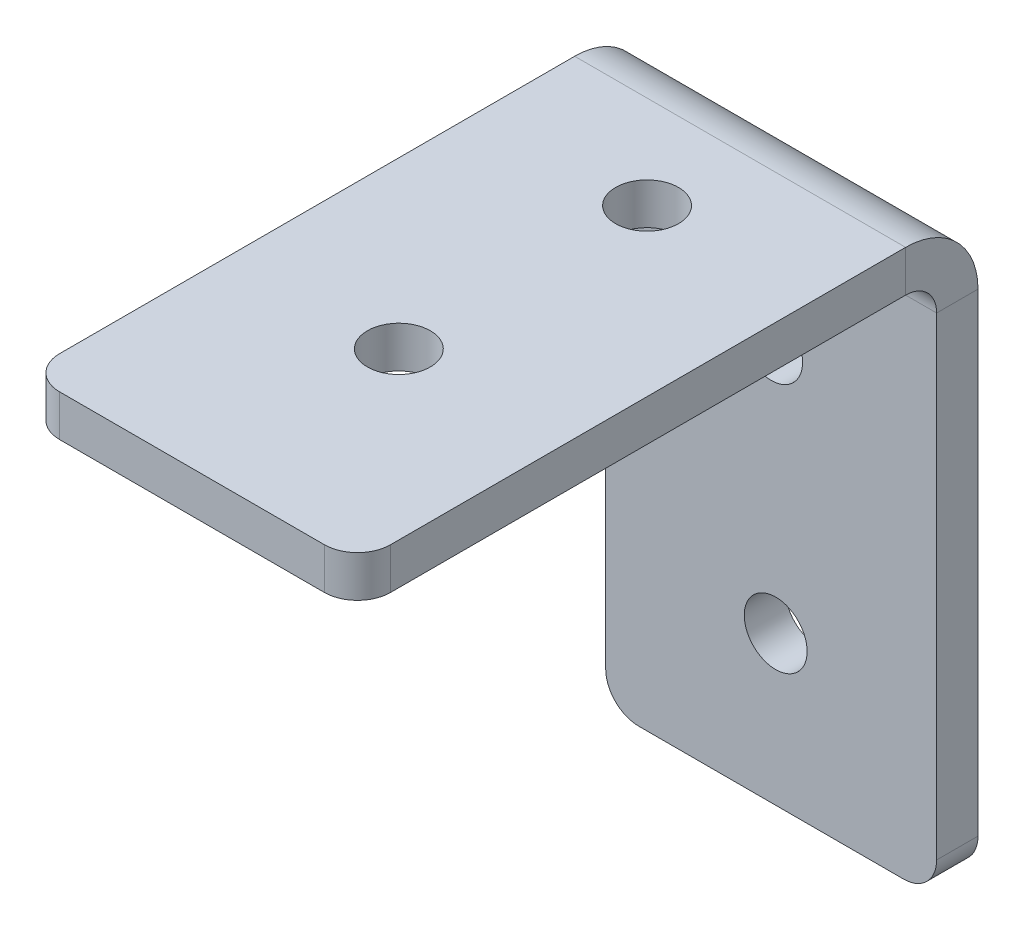
ISO-10303-21;
HEADER;
FILE_DESCRIPTION(('STEP AP214'),'2;1');
FILE_NAME('part.step','',(''),(''),'','','');
FILE_SCHEMA(('AUTOMOTIVE_DESIGN { 1 0 10303 214 1 1 1 1 }'));
ENDSEC;
DATA;
#1=APPLICATION_CONTEXT('core data for automotive mechanical design processes');
#2=APPLICATION_PROTOCOL_DEFINITION('international standard','automotive_design',2000,#1);
#3=PRODUCT_CONTEXT('',#1,'mechanical');
#4=PRODUCT('Part','Part','',(#3));
#5=PRODUCT_RELATED_PRODUCT_CATEGORY('part','',(#4));
#6=PRODUCT_DEFINITION_FORMATION('','',#4);
#7=PRODUCT_DEFINITION_CONTEXT('part definition',#1,'design');
#8=PRODUCT_DEFINITION('design','',#6,#7);
#9=PRODUCT_DEFINITION_SHAPE('','',#8);
#10=(LENGTH_UNIT() NAMED_UNIT(*) SI_UNIT(.MILLI.,.METRE.));
#11=(NAMED_UNIT(*) PLANE_ANGLE_UNIT() SI_UNIT($,.RADIAN.));
#12=(NAMED_UNIT(*) SI_UNIT($,.STERADIAN.) SOLID_ANGLE_UNIT());
#13=UNCERTAINTY_MEASURE_WITH_UNIT(LENGTH_MEASURE(1.E-05),#10,'distance_accuracy_value','');
#14=(GEOMETRIC_REPRESENTATION_CONTEXT(3) GLOBAL_UNCERTAINTY_ASSIGNED_CONTEXT((#13)) GLOBAL_UNIT_ASSIGNED_CONTEXT((#10,
#11,#12)) REPRESENTATION_CONTEXT('',''));
#15=CARTESIAN_POINT('',(0.,0.,0.));
#16=DIRECTION('',(0.,0.,1.));
#17=DIRECTION('',(1.,0.,0.));
#18=AXIS2_PLACEMENT_3D('',#15,#16,#17);
#19=CARTESIAN_POINT('',(12.7,19.05,47.625));
#20=DIRECTION('',(1.,0.,0.));
#21=DIRECTION('',(0.,0.,-1.));
#22=AXIS2_PLACEMENT_3D('',#19,#20,#21);
#23=PLANE('',#22);
#24=DIRECTION('',(0.,-1.,0.));
#25=VECTOR('',#24,1.);
#26=CARTESIAN_POINT('',(12.7,19.05,5.555000066));
#27=LINE('',#26,#25);
#28=CARTESIAN_POINT('',(12.7,22.225,5.555000066));
#29=VERTEX_POINT('',#28);
#30=CARTESIAN_POINT('',(12.7,19.05,5.555000066));
#31=VERTEX_POINT('',#30);
#32=EDGE_CURVE('E11',#29,#31,#27,.T.);
#33=ORIENTED_EDGE('',*,*,#32,.F.);
#34=DIRECTION('',(0.,0.,1.));
#35=VECTOR('',#34,1.);
#36=CARTESIAN_POINT('',(12.7,22.225,47.625));
#37=LINE('',#36,#35);
#38=CARTESIAN_POINT('',(12.7,22.225,45.085));
#39=VERTEX_POINT('',#38);
#40=EDGE_CURVE('E102',#39,#29,#37,.F.);
#41=ORIENTED_EDGE('',*,*,#40,.F.);
#42=DIRECTION('',(0.,-1.,0.));
#43=VECTOR('',#42,1.);
#44=CARTESIAN_POINT('',(12.7,19.05,45.085));
#45=LINE('',#44,#43);
#46=CARTESIAN_POINT('',(12.7,19.05,45.085));
#47=VERTEX_POINT('',#46);
#48=EDGE_CURVE('E50',#39,#47,#45,.T.);
#49=ORIENTED_EDGE('',*,*,#48,.T.);
#50=DIRECTION('',(0.,0.,-1.));
#51=VECTOR('',#50,1.);
#52=CARTESIAN_POINT('',(12.7,19.05,47.625));
#53=LINE('',#52,#51);
#54=EDGE_CURVE('E105',#47,#31,#53,.T.);
#55=ORIENTED_EDGE('',*,*,#54,.T.);
#56=EDGE_LOOP('',(#33,#41,#49,#55));
#57=FACE_BOUND('',#56,.T.);
#58=ADVANCED_FACE('F40',(#57),#23,.T.);
#59=CARTESIAN_POINT('',(10.16,19.05,45.085));
#60=DIRECTION('',(0.,1.,0.));
#61=DIRECTION('',(-1.,0.,0.));
#62=AXIS2_PLACEMENT_3D('',#59,#60,#61);
#63=CYLINDRICAL_SURFACE('',#62,2.54);
#64=ORIENTED_EDGE('',*,*,#48,.F.);
#65=CARTESIAN_POINT('',(10.16,22.225,45.085));
#66=DIRECTION('',(0.,1.,0.));
#67=DIRECTION('',(-1.,0.,0.));
#68=AXIS2_PLACEMENT_3D('',#65,#66,#67);
#69=CIRCLE('',#68,2.54);
#70=CARTESIAN_POINT('',(10.16,22.225,47.625));
#71=VERTEX_POINT('',#70);
#72=EDGE_CURVE('E131',#39,#71,#69,.F.);
#73=ORIENTED_EDGE('',*,*,#72,.T.);
#74=DIRECTION('',(0.,-1.,0.));
#75=VECTOR('',#74,1.);
#76=CARTESIAN_POINT('',(10.16,19.05,47.625));
#77=LINE('',#76,#75);
#78=CARTESIAN_POINT('',(10.16,19.05,47.625));
#79=VERTEX_POINT('',#78);
#80=EDGE_CURVE('E168',#71,#79,#77,.T.);
#81=ORIENTED_EDGE('',*,*,#80,.T.);
#82=CARTESIAN_POINT('',(10.16,19.05,45.085));
#83=DIRECTION('',(0.,1.,0.));
#84=DIRECTION('',(-1.,0.,0.));
#85=AXIS2_PLACEMENT_3D('',#82,#83,#84);
#86=CIRCLE('',#85,2.54);
#87=EDGE_CURVE('E180',#47,#79,#86,.F.);
#88=ORIENTED_EDGE('',*,*,#87,.F.);
#89=EDGE_LOOP('',(#64,#73,#81,#88));
#90=FACE_BOUND('',#89,.T.);
#91=ADVANCED_FACE('F186',(#90),#63,.T.);
#92=CARTESIAN_POINT('',(-12.7,19.05,47.625));
#93=DIRECTION('',(0.,0.,1.));
#94=DIRECTION('',(1.,0.,0.));
#95=AXIS2_PLACEMENT_3D('',#92,#93,#94);
#96=PLANE('',#95);
#97=ORIENTED_EDGE('',*,*,#80,.F.);
#98=DIRECTION('',(-1.,0.,0.));
#99=VECTOR('',#98,1.);
#100=CARTESIAN_POINT('',(-12.7,22.225,47.625));
#101=LINE('',#100,#99);
#102=CARTESIAN_POINT('',(-10.16,22.225,47.625));
#103=VERTEX_POINT('',#102);
#104=EDGE_CURVE('E252',#103,#71,#101,.F.);
#105=ORIENTED_EDGE('',*,*,#104,.F.);
#106=DIRECTION('',(0.,-1.,0.));
#107=VECTOR('',#106,1.);
#108=CARTESIAN_POINT('',(-10.16,19.05,47.625));
#109=LINE('',#108,#107);
#110=CARTESIAN_POINT('',(-10.16,19.05,47.625));
#111=VERTEX_POINT('',#110);
#112=EDGE_CURVE('E165',#103,#111,#109,.T.);
#113=ORIENTED_EDGE('',*,*,#112,.T.);
#114=DIRECTION('',(1.,0.,0.));
#115=VECTOR('',#114,1.);
#116=CARTESIAN_POINT('',(-12.7,19.05,47.625));
#117=LINE('',#116,#115);
#118=EDGE_CURVE('E187',#111,#79,#117,.T.);
#119=ORIENTED_EDGE('',*,*,#118,.T.);
#120=EDGE_LOOP('',(#97,#105,#113,#119));
#121=FACE_BOUND('',#120,.T.);
#122=ADVANCED_FACE('F256',(#121),#96,.T.);
#123=CARTESIAN_POINT('',(-10.16,19.05,45.085));
#124=DIRECTION('',(0.,1.,0.));
#125=DIRECTION('',(-1.,0.,0.));
#126=AXIS2_PLACEMENT_3D('',#123,#124,#125);
#127=CYLINDRICAL_SURFACE('',#126,2.54);
#128=ORIENTED_EDGE('',*,*,#112,.F.);
#129=CARTESIAN_POINT('',(-10.16,22.225,45.085));
#130=DIRECTION('',(0.,1.,0.));
#131=DIRECTION('',(-1.,0.,0.));
#132=AXIS2_PLACEMENT_3D('',#129,#130,#131);
#133=CIRCLE('',#132,2.54);
#134=CARTESIAN_POINT('',(-12.7,22.225,45.085));
#135=VERTEX_POINT('',#134);
#136=EDGE_CURVE('E249',#103,#135,#133,.F.);
#137=ORIENTED_EDGE('',*,*,#136,.T.);
#138=DIRECTION('',(0.,-1.,0.));
#139=VECTOR('',#138,1.);
#140=CARTESIAN_POINT('',(-12.7,19.05,45.085));
#141=LINE('',#140,#139);
#142=CARTESIAN_POINT('',(-12.7,19.05,45.085));
#143=VERTEX_POINT('',#142);
#144=EDGE_CURVE('E162',#135,#143,#141,.T.);
#145=ORIENTED_EDGE('',*,*,#144,.T.);
#146=CARTESIAN_POINT('',(-10.16,19.05,45.085));
#147=DIRECTION('',(0.,1.,0.));
#148=DIRECTION('',(-1.,0.,0.));
#149=AXIS2_PLACEMENT_3D('',#146,#147,#148);
#150=CIRCLE('',#149,2.54);
#151=EDGE_CURVE('E189',#111,#143,#150,.F.);
#152=ORIENTED_EDGE('',*,*,#151,.F.);
#153=EDGE_LOOP('',(#128,#137,#145,#152));
#154=FACE_BOUND('',#153,.T.);
#155=ADVANCED_FACE('F264',(#154),#127,.T.);
#156=CARTESIAN_POINT('',(-12.7,19.05,47.625));
#157=DIRECTION('',(1.,0.,0.));
#158=DIRECTION('',(0.,0.,-1.));
#159=AXIS2_PLACEMENT_3D('',#156,#157,#158);
#160=PLANE('',#159);
#161=ORIENTED_EDGE('',*,*,#144,.F.);
#162=DIRECTION('',(0.,0.,1.));
#163=VECTOR('',#162,1.);
#164=CARTESIAN_POINT('',(-12.7,22.225,47.625));
#165=LINE('',#164,#163);
#166=CARTESIAN_POINT('',(-12.7,22.225,5.555000066));
#167=VERTEX_POINT('',#166);
#168=EDGE_CURVE('E232',#135,#167,#165,.F.);
#169=ORIENTED_EDGE('',*,*,#168,.T.);
#170=DIRECTION('',(0.,-1.,0.));
#171=VECTOR('',#170,1.);
#172=CARTESIAN_POINT('',(-12.7,19.05,5.555000066));
#173=LINE('',#172,#171);
#174=CARTESIAN_POINT('',(-12.7,19.05,5.555000066));
#175=VERTEX_POINT('',#174);
#176=EDGE_CURVE('E159',#167,#175,#173,.T.);
#177=ORIENTED_EDGE('',*,*,#176,.T.);
#178=DIRECTION('',(0.,0.,-1.));
#179=VECTOR('',#178,1.);
#180=CARTESIAN_POINT('',(-12.7,19.05,47.625));
#181=LINE('',#180,#179);
#182=EDGE_CURVE('E195',#143,#175,#181,.T.);
#183=ORIENTED_EDGE('',*,*,#182,.F.);
#184=EDGE_LOOP('',(#161,#169,#177,#183));
#185=FACE_BOUND('',#184,.T.);
#186=ADVANCED_FACE('F268',(#185),#160,.F.);
#187=CARTESIAN_POINT('',(-12.7,16.669999934,5.555000066));
#188=DIRECTION('',(-1.,0.,0.));
#189=DIRECTION('',(0.,0.,1.));
#190=AXIS2_PLACEMENT_3D('',#187,#188,#189);
#191=PLANE('',#190);
#192=ORIENTED_EDGE('',*,*,#176,.F.);
#193=CARTESIAN_POINT('',(-12.7,16.669999934,5.555000066));
#194=DIRECTION('',(-1.,0.,0.));
#195=DIRECTION('',(0.,-1.,0.));
#196=AXIS2_PLACEMENT_3D('',#193,#194,#195);
#197=CIRCLE('',#196,5.555000066);
#198=CARTESIAN_POINT('',(-12.7,16.669999934,0.));
#199=VERTEX_POINT('',#198);
#200=EDGE_CURVE('E120',#167,#199,#197,.T.);
#201=ORIENTED_EDGE('',*,*,#200,.T.);
#202=DIRECTION('',(0.,0.,1.));
#203=VECTOR('',#202,1.);
#204=CARTESIAN_POINT('',(-12.7,16.669999934,3.175));
#205=LINE('',#204,#203);
#206=CARTESIAN_POINT('',(-12.7,16.669999934,3.175));
#207=VERTEX_POINT('',#206);
#208=EDGE_CURVE('E58',#199,#207,#205,.T.);
#209=ORIENTED_EDGE('',*,*,#208,.T.);
#210=CARTESIAN_POINT('',(-12.7,16.669999934,5.555000066));
#211=DIRECTION('',(1.,0.,0.));
#212=DIRECTION('',(0.,0.,-1.));
#213=AXIS2_PLACEMENT_3D('',#210,#211,#212);
#214=CIRCLE('',#213,2.380000066);
#215=EDGE_CURVE('E224',#175,#207,#214,.F.);
#216=ORIENTED_EDGE('',*,*,#215,.F.);
#217=EDGE_LOOP('',(#192,#201,#209,#216));
#218=FACE_BOUND('',#217,.T.);
#219=ADVANCED_FACE('F269',(#218),#191,.T.);
#220=CARTESIAN_POINT('',(-12.7,-22.225,3.175));
#221=DIRECTION('',(1.,0.,0.));
#222=DIRECTION('',(0.,-1.,0.));
#223=AXIS2_PLACEMENT_3D('',#220,#221,#222);
#224=PLANE('',#223);
#225=ORIENTED_EDGE('',*,*,#208,.F.);
#226=DIRECTION('',(0.,1.,0.));
#227=VECTOR('',#226,1.);
#228=CARTESIAN_POINT('',(-12.7,0.,0.));
#229=LINE('',#228,#227);
#230=CARTESIAN_POINT('',(-12.7,-19.685,0.));
#231=VERTEX_POINT('',#230);
#232=EDGE_CURVE('E238',#199,#231,#229,.F.);
#233=ORIENTED_EDGE('',*,*,#232,.T.);
#234=DIRECTION('',(0.,0.,1.));
#235=VECTOR('',#234,1.);
#236=CARTESIAN_POINT('',(-12.7,-19.685,3.175));
#237=LINE('',#236,#235);
#238=CARTESIAN_POINT('',(-12.7,-19.685,3.175));
#239=VERTEX_POINT('',#238);
#240=EDGE_CURVE('E155',#231,#239,#237,.T.);
#241=ORIENTED_EDGE('',*,*,#240,.T.);
#242=DIRECTION('',(0.,-1.,0.));
#243=VECTOR('',#242,1.);
#244=CARTESIAN_POINT('',(-12.7,-22.225,3.175));
#245=LINE('',#244,#243);
#246=EDGE_CURVE('E212',#207,#239,#245,.T.);
#247=ORIENTED_EDGE('',*,*,#246,.F.);
#248=EDGE_LOOP('',(#225,#233,#241,#247));
#249=FACE_BOUND('',#248,.T.);
#250=ADVANCED_FACE('F302',(#249),#224,.F.);
#251=CARTESIAN_POINT('',(-10.16,-19.685,3.175));
#252=DIRECTION('',(0.,0.,-1.));
#253=DIRECTION('',(-1.,0.,0.));
#254=AXIS2_PLACEMENT_3D('',#251,#252,#253);
#255=CYLINDRICAL_SURFACE('',#254,2.54);
#256=ORIENTED_EDGE('',*,*,#240,.F.);
#257=CARTESIAN_POINT('',(-10.16,-19.685,0.));
#258=DIRECTION('',(0.,0.,-1.));
#259=DIRECTION('',(-1.,0.,0.));
#260=AXIS2_PLACEMENT_3D('',#257,#258,#259);
#261=CIRCLE('',#260,2.54);
#262=CARTESIAN_POINT('',(-10.16,-22.225,0.));
#263=VERTEX_POINT('',#262);
#264=EDGE_CURVE('E125',#231,#263,#261,.F.);
#265=ORIENTED_EDGE('',*,*,#264,.T.);
#266=DIRECTION('',(0.,0.,1.));
#267=VECTOR('',#266,1.);
#268=CARTESIAN_POINT('',(-10.16,-22.225,3.175));
#269=LINE('',#268,#267);
#270=CARTESIAN_POINT('',(-10.16,-22.225,3.175));
#271=VERTEX_POINT('',#270);
#272=EDGE_CURVE('E152',#263,#271,#269,.T.);
#273=ORIENTED_EDGE('',*,*,#272,.T.);
#274=CARTESIAN_POINT('',(-10.16,-19.685,3.175));
#275=DIRECTION('',(0.,0.,-1.));
#276=DIRECTION('',(-1.,0.,0.));
#277=AXIS2_PLACEMENT_3D('',#274,#275,#276);
#278=CIRCLE('',#277,2.54);
#279=EDGE_CURVE('E215',#239,#271,#278,.F.);
#280=ORIENTED_EDGE('',*,*,#279,.F.);
#281=EDGE_LOOP('',(#256,#265,#273,#280));
#282=FACE_BOUND('',#281,.T.);
#283=ADVANCED_FACE('F304',(#282),#255,.T.);
#284=CARTESIAN_POINT('',(-12.7,-22.225,3.175));
#285=DIRECTION('',(0.,1.,0.));
#286=DIRECTION('',(1.,0.,0.));
#287=AXIS2_PLACEMENT_3D('',#284,#285,#286);
#288=PLANE('',#287);
#289=ORIENTED_EDGE('',*,*,#272,.F.);
#290=DIRECTION('',(-1.,0.,0.));
#291=VECTOR('',#290,1.);
#292=CARTESIAN_POINT('',(0.,-22.225,0.));
#293=LINE('',#292,#291);
#294=CARTESIAN_POINT('',(10.16,-22.225,0.));
#295=VERTEX_POINT('',#294);
#296=EDGE_CURVE('E235',#263,#295,#293,.F.);
#297=ORIENTED_EDGE('',*,*,#296,.T.);
#298=DIRECTION('',(0.,0.,1.));
#299=VECTOR('',#298,1.);
#300=CARTESIAN_POINT('',(10.16,-22.225,3.175));
#301=LINE('',#300,#299);
#302=CARTESIAN_POINT('',(10.16,-22.225,3.175));
#303=VERTEX_POINT('',#302);
#304=EDGE_CURVE('E149',#295,#303,#301,.T.);
#305=ORIENTED_EDGE('',*,*,#304,.T.);
#306=DIRECTION('',(1.,0.,0.));
#307=VECTOR('',#306,1.);
#308=CARTESIAN_POINT('',(-12.7,-22.225,3.175));
#309=LINE('',#308,#307);
#310=EDGE_CURVE('E203',#271,#303,#309,.T.);
#311=ORIENTED_EDGE('',*,*,#310,.F.);
#312=EDGE_LOOP('',(#289,#297,#305,#311));
#313=FACE_BOUND('',#312,.T.);
#314=ADVANCED_FACE('F284',(#313),#288,.F.);
#315=CARTESIAN_POINT('',(10.16,-19.685,3.175));
#316=DIRECTION('',(0.,0.,-1.));
#317=DIRECTION('',(-1.,0.,0.));
#318=AXIS2_PLACEMENT_3D('',#315,#316,#317);
#319=CYLINDRICAL_SURFACE('',#318,2.54);
#320=ORIENTED_EDGE('',*,*,#304,.F.);
#321=CARTESIAN_POINT('',(10.16,-19.685,0.));
#322=DIRECTION('',(0.,0.,-1.));
#323=DIRECTION('',(-1.,0.,0.));
#324=AXIS2_PLACEMENT_3D('',#321,#322,#323);
#325=CIRCLE('',#324,2.54);
#326=CARTESIAN_POINT('',(12.7,-19.685,0.));
#327=VERTEX_POINT('',#326);
#328=EDGE_CURVE('E239',#295,#327,#325,.F.);
#329=ORIENTED_EDGE('',*,*,#328,.T.);
#330=DIRECTION('',(0.,0.,1.));
#331=VECTOR('',#330,1.);
#332=CARTESIAN_POINT('',(12.7,-19.685,3.175));
#333=LINE('',#332,#331);
#334=CARTESIAN_POINT('',(12.7,-19.685,3.175));
#335=VERTEX_POINT('',#334);
#336=EDGE_CURVE('E146',#327,#335,#333,.T.);
#337=ORIENTED_EDGE('',*,*,#336,.T.);
#338=CARTESIAN_POINT('',(10.16,-19.685,3.175));
#339=DIRECTION('',(0.,0.,-1.));
#340=DIRECTION('',(-1.,0.,0.));
#341=AXIS2_PLACEMENT_3D('',#338,#339,#340);
#342=CIRCLE('',#341,2.54);
#343=EDGE_CURVE('E206',#303,#335,#342,.F.);
#344=ORIENTED_EDGE('',*,*,#343,.F.);
#345=EDGE_LOOP('',(#320,#329,#337,#344));
#346=FACE_BOUND('',#345,.T.);
#347=ADVANCED_FACE('F293',(#346),#319,.T.);
#348=CARTESIAN_POINT('',(12.7,-22.225,3.175));
#349=DIRECTION('',(-1.,0.,0.));
#350=DIRECTION('',(0.,1.,0.));
#351=AXIS2_PLACEMENT_3D('',#348,#349,#350);
#352=PLANE('',#351);
#353=ORIENTED_EDGE('',*,*,#336,.F.);
#354=DIRECTION('',(0.,1.,0.));
#355=VECTOR('',#354,1.);
#356=CARTESIAN_POINT('',(12.7,0.,0.));
#357=LINE('',#356,#355);
#358=CARTESIAN_POINT('',(12.7,16.669999934,0.));
#359=VERTEX_POINT('',#358);
#360=EDGE_CURVE('E236',#327,#359,#357,.T.);
#361=ORIENTED_EDGE('',*,*,#360,.T.);
#362=DIRECTION('',(0.,0.,1.));
#363=VECTOR('',#362,1.);
#364=CARTESIAN_POINT('',(12.7,16.669999934,3.175));
#365=LINE('',#364,#363);
#366=CARTESIAN_POINT('',(12.7,16.669999934,3.175));
#367=VERTEX_POINT('',#366);
#368=EDGE_CURVE('E44',#359,#367,#365,.T.);
#369=ORIENTED_EDGE('',*,*,#368,.T.);
#370=DIRECTION('',(0.,1.,0.));
#371=VECTOR('',#370,1.);
#372=CARTESIAN_POINT('',(12.7,-22.225,3.175));
#373=LINE('',#372,#371);
#374=EDGE_CURVE('E209',#335,#367,#373,.T.);
#375=ORIENTED_EDGE('',*,*,#374,.F.);
#376=EDGE_LOOP('',(#353,#361,#369,#375));
#377=FACE_BOUND('',#376,.T.);
#378=ADVANCED_FACE('F296',(#377),#352,.F.);
#379=CARTESIAN_POINT('',(0.,19.05,12.7));
#380=DIRECTION('',(0.,1.,0.));
#381=DIRECTION('',(-1.,0.,0.));
#382=AXIS2_PLACEMENT_3D('',#379,#380,#381);
#383=CYLINDRICAL_SURFACE('',#382,2.413);
#384=CARTESIAN_POINT('',(0.,19.05,12.7));
#385=DIRECTION('',(0.,1.,0.));
#386=DIRECTION('',(-1.,0.,0.));
#387=AXIS2_PLACEMENT_3D('',#384,#385,#386);
#388=CIRCLE('',#387,2.413);
#389=CARTESIAN_POINT('',(-2.413,19.05,12.7));
#390=VERTEX_POINT('',#389);
#391=EDGE_CURVE('E226',#390,#390,#388,.T.);
#392=ORIENTED_EDGE('',*,*,#391,.F.);
#393=EDGE_LOOP('',(#392));
#394=FACE_BOUND('',#393,.T.);
#395=CARTESIAN_POINT('',(0.,22.225,12.7));
#396=DIRECTION('',(0.,1.,0.));
#397=DIRECTION('',(-1.,0.,0.));
#398=AXIS2_PLACEMENT_3D('',#395,#396,#397);
#399=CIRCLE('',#398,2.413);
#400=CARTESIAN_POINT('',(-2.413,22.225,12.7));
#401=VERTEX_POINT('',#400);
#402=EDGE_CURVE('E138',#401,#401,#399,.T.);
#403=ORIENTED_EDGE('',*,*,#402,.T.);
#404=EDGE_LOOP('',(#403));
#405=FACE_BOUND('',#404,.T.);
#406=ADVANCED_FACE('F323',(#394,#405),#383,.F.);
#407=CARTESIAN_POINT('',(0.,19.05,31.75));
#408=DIRECTION('',(0.,1.,0.));
#409=DIRECTION('',(-1.,0.,0.));
#410=AXIS2_PLACEMENT_3D('',#407,#408,#409);
#411=CYLINDRICAL_SURFACE('',#410,2.413);
#412=CARTESIAN_POINT('',(0.,19.05,31.75));
#413=DIRECTION('',(0.,1.,0.));
#414=DIRECTION('',(-1.,0.,0.));
#415=AXIS2_PLACEMENT_3D('',#412,#413,#414);
#416=CIRCLE('',#415,2.413);
#417=CARTESIAN_POINT('',(-2.413,19.05,31.75));
#418=VERTEX_POINT('',#417);
#419=EDGE_CURVE('E184',#418,#418,#416,.T.);
#420=ORIENTED_EDGE('',*,*,#419,.F.);
#421=EDGE_LOOP('',(#420));
#422=FACE_BOUND('',#421,.T.);
#423=CARTESIAN_POINT('',(0.,22.225,31.75));
#424=DIRECTION('',(0.,1.,0.));
#425=DIRECTION('',(-1.,0.,0.));
#426=AXIS2_PLACEMENT_3D('',#423,#424,#425);
#427=CIRCLE('',#426,2.413);
#428=CARTESIAN_POINT('',(-2.413,22.225,31.75));
#429=VERTEX_POINT('',#428);
#430=EDGE_CURVE('E132',#429,#429,#427,.T.);
#431=ORIENTED_EDGE('',*,*,#430,.T.);
#432=EDGE_LOOP('',(#431));
#433=FACE_BOUND('',#432,.T.);
#434=ADVANCED_FACE('F42',(#422,#433),#411,.F.);
#435=CARTESIAN_POINT('',(0.348627450980393,-10.795,3.175));
#436=DIRECTION('',(0.,0.,-1.));
#437=DIRECTION('',(-1.,0.,0.));
#438=AXIS2_PLACEMENT_3D('',#435,#436,#437);
#439=CYLINDRICAL_SURFACE('',#438,2.413);
#440=CARTESIAN_POINT('',(0.348627450980393,-10.795,3.175));
#441=DIRECTION('',(0.,0.,1.));
#442=DIRECTION('',(1.,0.,0.));
#443=AXIS2_PLACEMENT_3D('',#440,#441,#442);
#444=CIRCLE('',#443,2.413);
#445=CARTESIAN_POINT('',(2.76162745098039,-10.795,3.175));
#446=VERTEX_POINT('',#445);
#447=EDGE_CURVE('E197',#446,#446,#444,.T.);
#448=ORIENTED_EDGE('',*,*,#447,.T.);
#449=EDGE_LOOP('',(#448));
#450=FACE_BOUND('',#449,.T.);
#451=CARTESIAN_POINT('',(0.348627450980393,-10.795,0.));
#452=DIRECTION('',(0.,0.,1.));
#453=DIRECTION('',(1.,0.,0.));
#454=AXIS2_PLACEMENT_3D('',#451,#452,#453);
#455=CIRCLE('',#454,2.413);
#456=CARTESIAN_POINT('',(2.76162745098039,-10.795,0.));
#457=VERTEX_POINT('',#456);
#458=EDGE_CURVE('E228',#457,#457,#455,.T.);
#459=ORIENTED_EDGE('',*,*,#458,.F.);
#460=EDGE_LOOP('',(#459));
#461=FACE_BOUND('',#460,.T.);
#462=ADVANCED_FACE('F330',(#450,#461),#439,.F.);
#463=CARTESIAN_POINT('',(0.,8.25499999999999,3.175));
#464=DIRECTION('',(0.,0.,-1.));
#465=DIRECTION('',(-1.,0.,0.));
#466=AXIS2_PLACEMENT_3D('',#463,#464,#465);
#467=CYLINDRICAL_SURFACE('',#466,2.413);
#468=CARTESIAN_POINT('',(0.,8.25499999999999,3.175));
#469=DIRECTION('',(0.,0.,1.));
#470=DIRECTION('',(1.,0.,0.));
#471=AXIS2_PLACEMENT_3D('',#468,#469,#470);
#472=CIRCLE('',#471,2.413);
#473=CARTESIAN_POINT('',(2.413,8.25499999999999,3.175));
#474=VERTEX_POINT('',#473);
#475=EDGE_CURVE('E200',#474,#474,#472,.T.);
#476=ORIENTED_EDGE('',*,*,#475,.T.);
#477=EDGE_LOOP('',(#476));
#478=FACE_BOUND('',#477,.T.);
#479=CARTESIAN_POINT('',(0.,8.25499999999999,0.));
#480=DIRECTION('',(0.,0.,1.));
#481=DIRECTION('',(1.,0.,0.));
#482=AXIS2_PLACEMENT_3D('',#479,#480,#481);
#483=CIRCLE('',#482,2.413);
#484=CARTESIAN_POINT('',(2.413,8.25499999999999,0.));
#485=VERTEX_POINT('',#484);
#486=EDGE_CURVE('E231',#485,#485,#483,.T.);
#487=ORIENTED_EDGE('',*,*,#486,.F.);
#488=EDGE_LOOP('',(#487));
#489=FACE_BOUND('',#488,.T.);
#490=ADVANCED_FACE('F322',(#478,#489),#467,.F.);
#491=CARTESIAN_POINT('',(12.7,16.669999934,5.555000066));
#492=DIRECTION('',(-1.,0.,0.));
#493=DIRECTION('',(0.,0.,1.));
#494=AXIS2_PLACEMENT_3D('',#491,#492,#493);
#495=PLANE('',#494);
#496=CARTESIAN_POINT('',(12.7,16.669999934,5.555000066));
#497=DIRECTION('',(-1.,0.,0.));
#498=DIRECTION('',(0.,-1.,0.));
#499=AXIS2_PLACEMENT_3D('',#496,#497,#498);
#500=CIRCLE('',#499,5.555000066);
#501=EDGE_CURVE('E118',#359,#29,#500,.F.);
#502=ORIENTED_EDGE('',*,*,#501,.T.);
#503=ORIENTED_EDGE('',*,*,#32,.T.);
#504=CARTESIAN_POINT('',(12.7,16.669999934,5.555000066));
#505=DIRECTION('',(1.,0.,0.));
#506=DIRECTION('',(0.,0.,-1.));
#507=AXIS2_PLACEMENT_3D('',#504,#505,#506);
#508=CIRCLE('',#507,2.380000066);
#509=EDGE_CURVE('E222',#367,#31,#508,.T.);
#510=ORIENTED_EDGE('',*,*,#509,.F.);
#511=ORIENTED_EDGE('',*,*,#368,.F.);
#512=EDGE_LOOP('',(#502,#503,#510,#511));
#513=FACE_BOUND('',#512,.T.);
#514=ADVANCED_FACE('F135',(#513),#495,.F.);
#515=CARTESIAN_POINT('',(0.,0.,3.175));
#516=DIRECTION('',(0.,0.,-1.));
#517=DIRECTION('',(-1.,0.,0.));
#518=AXIS2_PLACEMENT_3D('',#515,#516,#517);
#519=PLANE('',#518);
#520=ORIENTED_EDGE('',*,*,#447,.F.);
#521=EDGE_LOOP('',(#520));
#522=FACE_BOUND('',#521,.T.);
#523=ORIENTED_EDGE('',*,*,#475,.F.);
#524=EDGE_LOOP('',(#523));
#525=FACE_BOUND('',#524,.T.);
#526=ORIENTED_EDGE('',*,*,#374,.T.);
#527=DIRECTION('',(1.,0.,0.));
#528=VECTOR('',#527,1.);
#529=CARTESIAN_POINT('',(-12.7,16.669999934,3.175));
#530=LINE('',#529,#528);
#531=EDGE_CURVE('E219',#367,#207,#530,.F.);
#532=ORIENTED_EDGE('',*,*,#531,.T.);
#533=ORIENTED_EDGE('',*,*,#246,.T.);
#534=ORIENTED_EDGE('',*,*,#279,.T.);
#535=ORIENTED_EDGE('',*,*,#310,.T.);
#536=ORIENTED_EDGE('',*,*,#343,.T.);
#537=EDGE_LOOP('',(#526,#532,#533,#534,#535,#536));
#538=FACE_BOUND('',#537,.T.);
#539=ADVANCED_FACE('F290',(#522,#525,#538),#519,.F.);
#540=CARTESIAN_POINT('',(-12.7,19.05,47.625));
#541=DIRECTION('',(0.,1.,0.));
#542=DIRECTION('',(-1.,0.,0.));
#543=AXIS2_PLACEMENT_3D('',#540,#541,#542);
#544=PLANE('',#543);
#545=ORIENTED_EDGE('',*,*,#391,.T.);
#546=EDGE_LOOP('',(#545));
#547=FACE_BOUND('',#546,.T.);
#548=ORIENTED_EDGE('',*,*,#419,.T.);
#549=EDGE_LOOP('',(#548));
#550=FACE_BOUND('',#549,.T.);
#551=ORIENTED_EDGE('',*,*,#182,.T.);
#552=DIRECTION('',(1.,0.,0.));
#553=VECTOR('',#552,1.);
#554=CARTESIAN_POINT('',(12.7,19.05,5.555000066));
#555=LINE('',#554,#553);
#556=EDGE_CURVE('E183',#175,#31,#555,.T.);
#557=ORIENTED_EDGE('',*,*,#556,.T.);
#558=ORIENTED_EDGE('',*,*,#54,.F.);
#559=ORIENTED_EDGE('',*,*,#87,.T.);
#560=ORIENTED_EDGE('',*,*,#118,.F.);
#561=ORIENTED_EDGE('',*,*,#151,.T.);
#562=EDGE_LOOP('',(#551,#557,#558,#559,#560,#561));
#563=FACE_BOUND('',#562,.T.);
#564=ADVANCED_FACE('F178',(#547,#550,#563),#544,.F.);
#565=CARTESIAN_POINT('',(-12.7,16.669999934,5.555000066));
#566=DIRECTION('',(-1.,0.,0.));
#567=DIRECTION('',(0.,-1.,0.));
#568=AXIS2_PLACEMENT_3D('',#565,#566,#567);
#569=CYLINDRICAL_SURFACE('',#568,2.380000066);
#570=ORIENTED_EDGE('',*,*,#215,.T.);
#571=ORIENTED_EDGE('',*,*,#531,.F.);
#572=ORIENTED_EDGE('',*,*,#509,.T.);
#573=ORIENTED_EDGE('',*,*,#556,.F.);
#574=EDGE_LOOP('',(#570,#571,#572,#573));
#575=FACE_BOUND('',#574,.T.);
#576=ADVANCED_FACE('F273',(#575),#569,.F.);
#577=CARTESIAN_POINT('',(0.,0.,0.));
#578=DIRECTION('',(0.,0.,-1.));
#579=DIRECTION('',(-1.,0.,0.));
#580=AXIS2_PLACEMENT_3D('',#577,#578,#579);
#581=PLANE('',#580);
#582=ORIENTED_EDGE('',*,*,#458,.T.);
#583=EDGE_LOOP('',(#582));
#584=FACE_BOUND('',#583,.T.);
#585=ORIENTED_EDGE('',*,*,#486,.T.);
#586=EDGE_LOOP('',(#585));
#587=FACE_BOUND('',#586,.T.);
#588=ORIENTED_EDGE('',*,*,#360,.F.);
#589=ORIENTED_EDGE('',*,*,#328,.F.);
#590=ORIENTED_EDGE('',*,*,#296,.F.);
#591=ORIENTED_EDGE('',*,*,#264,.F.);
#592=ORIENTED_EDGE('',*,*,#232,.F.);
#593=DIRECTION('',(-1.,0.,0.));
#594=VECTOR('',#593,1.);
#595=CARTESIAN_POINT('',(0.,16.669999934,0.));
#596=LINE('',#595,#594);
#597=EDGE_CURVE('E124',#359,#199,#596,.T.);
#598=ORIENTED_EDGE('',*,*,#597,.F.);
#599=EDGE_LOOP('',(#588,#589,#590,#591,#592,#598));
#600=FACE_BOUND('',#599,.T.);
#601=ADVANCED_FACE('F298',(#584,#587,#600),#581,.T.);
#602=CARTESIAN_POINT('',(-12.7,22.225,47.625));
#603=DIRECTION('',(0.,1.,0.));
#604=DIRECTION('',(-1.,0.,0.));
#605=AXIS2_PLACEMENT_3D('',#602,#603,#604);
#606=PLANE('',#605);
#607=ORIENTED_EDGE('',*,*,#402,.F.);
#608=EDGE_LOOP('',(#607));
#609=FACE_BOUND('',#608,.T.);
#610=ORIENTED_EDGE('',*,*,#430,.F.);
#611=EDGE_LOOP('',(#610));
#612=FACE_BOUND('',#611,.T.);
#613=ORIENTED_EDGE('',*,*,#168,.F.);
#614=ORIENTED_EDGE('',*,*,#136,.F.);
#615=ORIENTED_EDGE('',*,*,#104,.T.);
#616=ORIENTED_EDGE('',*,*,#72,.F.);
#617=ORIENTED_EDGE('',*,*,#40,.T.);
#618=DIRECTION('',(-1.,0.,0.));
#619=VECTOR('',#618,1.);
#620=CARTESIAN_POINT('',(-12.7,22.225,5.555000066));
#621=LINE('',#620,#619);
#622=EDGE_CURVE('E115',#167,#29,#621,.F.);
#623=ORIENTED_EDGE('',*,*,#622,.F.);
#624=EDGE_LOOP('',(#613,#614,#615,#616,#617,#623));
#625=FACE_BOUND('',#624,.T.);
#626=ADVANCED_FACE('F128',(#609,#612,#625),#606,.T.);
#627=CARTESIAN_POINT('',(-12.7,16.669999934,5.555000066));
#628=DIRECTION('',(-1.,0.,0.));
#629=DIRECTION('',(0.,-1.,0.));
#630=AXIS2_PLACEMENT_3D('',#627,#628,#629);
#631=CYLINDRICAL_SURFACE('',#630,5.555000066);
#632=ORIENTED_EDGE('',*,*,#200,.F.);
#633=ORIENTED_EDGE('',*,*,#622,.T.);
#634=ORIENTED_EDGE('',*,*,#501,.F.);
#635=ORIENTED_EDGE('',*,*,#597,.T.);
#636=EDGE_LOOP('',(#632,#633,#634,#635));
#637=FACE_BOUND('',#636,.T.);
#638=ADVANCED_FACE('F116',(#637),#631,.T.);
#639=CLOSED_SHELL('',(#58,#91,#122,#155,#186,#219,#250,#283,#314,#347,#378,#406,#434,#462,#490,
#514,#539,#564,#576,#601,#626,#638));
#640=MANIFOLD_SOLID_BREP('B2',#639);
#641=ADVANCED_BREP_SHAPE_REPRESENTATION('',(#18,#640),#14);
#642=SHAPE_DEFINITION_REPRESENTATION(#9,#641);
ENDSEC;
END-ISO-10303-21;
